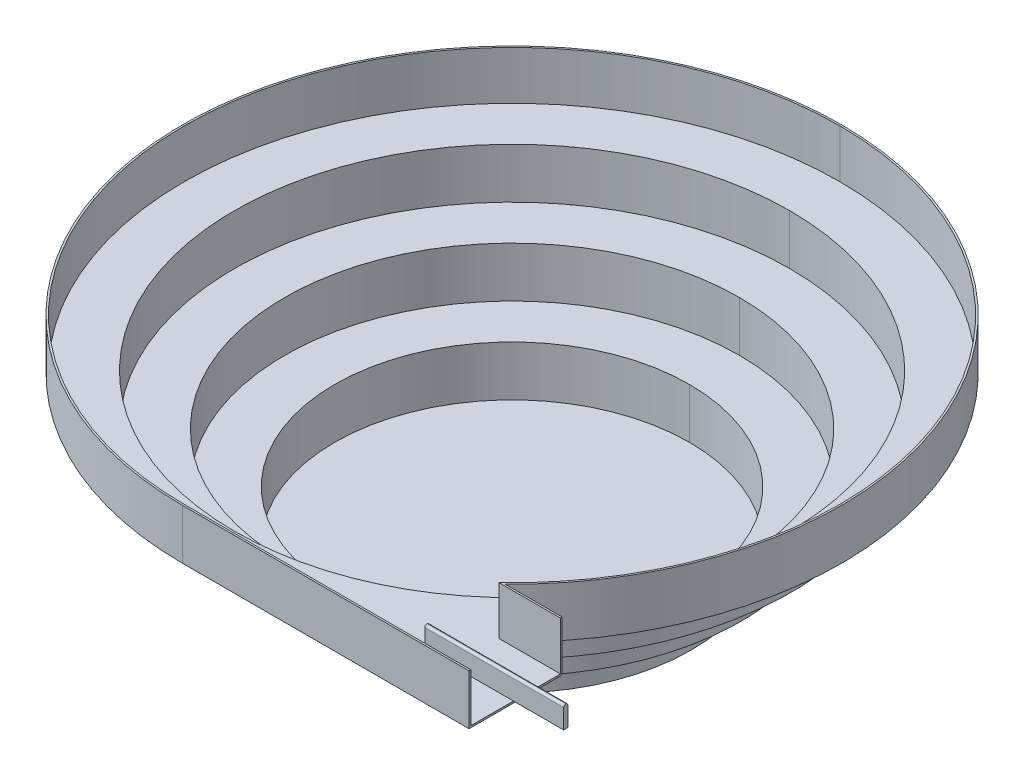
ISO-10303-21;
HEADER;
FILE_DESCRIPTION(('STEP AP214'),'2;1');
FILE_NAME('part.step','',(''),(''),'','','');
FILE_SCHEMA(('AUTOMOTIVE_DESIGN { 1 0 10303 214 1 1 1 1 }'));
ENDSEC;
DATA;
#1=APPLICATION_CONTEXT('core data for automotive mechanical design processes');
#2=APPLICATION_PROTOCOL_DEFINITION('international standard','automotive_design',2000,#1);
#3=PRODUCT_CONTEXT('',#1,'mechanical');
#4=PRODUCT('Part','Part','',(#3));
#5=PRODUCT_RELATED_PRODUCT_CATEGORY('part','',(#4));
#6=PRODUCT_DEFINITION_FORMATION('','',#4);
#7=PRODUCT_DEFINITION_CONTEXT('part definition',#1,'design');
#8=PRODUCT_DEFINITION('design','',#6,#7);
#9=PRODUCT_DEFINITION_SHAPE('','',#8);
#10=(LENGTH_UNIT() NAMED_UNIT(*) SI_UNIT(.MILLI.,.METRE.));
#11=(NAMED_UNIT(*) PLANE_ANGLE_UNIT() SI_UNIT($,.RADIAN.));
#12=(NAMED_UNIT(*) SI_UNIT($,.STERADIAN.) SOLID_ANGLE_UNIT());
#13=UNCERTAINTY_MEASURE_WITH_UNIT(LENGTH_MEASURE(1.E-05),#10,'distance_accuracy_value','');
#14=(GEOMETRIC_REPRESENTATION_CONTEXT(3) GLOBAL_UNCERTAINTY_ASSIGNED_CONTEXT((#13)) GLOBAL_UNIT_ASSIGNED_CONTEXT((#10,
#11,#12)) REPRESENTATION_CONTEXT('',''));
#15=CARTESIAN_POINT('',(0.,0.,0.));
#16=DIRECTION('',(0.,0.,1.));
#17=DIRECTION('',(1.,0.,0.));
#18=AXIS2_PLACEMENT_3D('',#15,#16,#17);
#19=CARTESIAN_POINT('',(0.,210.,0.));
#20=DIRECTION('',(0.,-1.,0.));
#21=DIRECTION('',(0.,0.,-1.));
#22=AXIS2_PLACEMENT_3D('',#19,#20,#21);
#23=CYLINDRICAL_SURFACE('',#22,387.5);
#24=CARTESIAN_POINT('',(0.,212.5,0.));
#25=DIRECTION('',(0.,1.,0.));
#26=DIRECTION('',(0.,0.,1.));
#27=AXIS2_PLACEMENT_3D('',#24,#25,#26);
#28=CIRCLE('',#27,387.5);
#29=CARTESIAN_POINT('',(0.,212.5,-387.5));
#30=VERTEX_POINT('',#29);
#31=CARTESIAN_POINT('',(0.,212.5,387.5));
#32=VERTEX_POINT('',#31);
#33=EDGE_CURVE('E11',#30,#32,#28,.T.);
#34=ORIENTED_EDGE('',*,*,#33,.T.);
#35=DIRECTION('',(0.,-1.,0.));
#36=VECTOR('',#35,1.);
#37=CARTESIAN_POINT('',(0.,210.,387.5));
#38=LINE('',#37,#36);
#39=CARTESIAN_POINT('',(0.,142.5,387.5));
#40=VERTEX_POINT('',#39);
#41=EDGE_CURVE('E27',#32,#40,#38,.T.);
#42=ORIENTED_EDGE('',*,*,#41,.T.);
#43=CARTESIAN_POINT('',(0.,142.5,0.));
#44=DIRECTION('',(0.,1.,0.));
#45=DIRECTION('',(0.,0.,1.));
#46=AXIS2_PLACEMENT_3D('',#43,#44,#45);
#47=CIRCLE('',#46,387.5);
#48=CARTESIAN_POINT('',(0.,142.5,-387.5));
#49=VERTEX_POINT('',#48);
#50=EDGE_CURVE('E335',#49,#40,#47,.T.);
#51=ORIENTED_EDGE('',*,*,#50,.F.);
#52=DIRECTION('',(0.,-1.,0.));
#53=VECTOR('',#52,1.);
#54=CARTESIAN_POINT('',(0.,210.,-387.5));
#55=LINE('',#54,#53);
#56=EDGE_CURVE('E451',#30,#49,#55,.T.);
#57=ORIENTED_EDGE('',*,*,#56,.F.);
#58=EDGE_LOOP('',(#34,#42,#51,#57));
#59=FACE_BOUND('',#58,.T.);
#60=ADVANCED_FACE('F16',(#59),#23,.F.);
#61=CARTESIAN_POINT('',(0.,140.,0.));
#62=DIRECTION('',(0.,-1.,0.));
#63=DIRECTION('',(0.,0.,-1.));
#64=AXIS2_PLACEMENT_3D('',#61,#62,#63);
#65=CYLINDRICAL_SURFACE('',#64,317.5);
#66=CARTESIAN_POINT('',(0.,142.5,0.));
#67=DIRECTION('',(0.,1.,0.));
#68=DIRECTION('',(0.,0.,1.));
#69=AXIS2_PLACEMENT_3D('',#66,#67,#68);
#70=CIRCLE('',#69,317.5);
#71=CARTESIAN_POINT('',(0.,142.5,-317.5));
#72=VERTEX_POINT('',#71);
#73=CARTESIAN_POINT('',(0.,142.5,317.5));
#74=VERTEX_POINT('',#73);
#75=EDGE_CURVE('E321',#72,#74,#70,.T.);
#76=ORIENTED_EDGE('',*,*,#75,.T.);
#77=DIRECTION('',(0.,-1.,0.));
#78=VECTOR('',#77,1.);
#79=CARTESIAN_POINT('',(0.,140.,317.5));
#80=LINE('',#79,#78);
#81=CARTESIAN_POINT('',(0.,72.5,317.5));
#82=VERTEX_POINT('',#81);
#83=EDGE_CURVE('E325',#74,#82,#80,.T.);
#84=ORIENTED_EDGE('',*,*,#83,.T.);
#85=CARTESIAN_POINT('',(0.,72.5,0.));
#86=DIRECTION('',(0.,1.,0.));
#87=DIRECTION('',(0.,0.,1.));
#88=AXIS2_PLACEMENT_3D('',#85,#86,#87);
#89=CIRCLE('',#88,317.5);
#90=CARTESIAN_POINT('',(0.,72.5,-317.5));
#91=VERTEX_POINT('',#90);
#92=EDGE_CURVE('E443',#91,#82,#89,.T.);
#93=ORIENTED_EDGE('',*,*,#92,.F.);
#94=DIRECTION('',(0.,-1.,0.));
#95=VECTOR('',#94,1.);
#96=CARTESIAN_POINT('',(0.,140.,-317.5));
#97=LINE('',#96,#95);
#98=EDGE_CURVE('E350',#72,#91,#97,.T.);
#99=ORIENTED_EDGE('',*,*,#98,.F.);
#100=EDGE_LOOP('',(#76,#84,#93,#99));
#101=FACE_BOUND('',#100,.T.);
#102=ADVANCED_FACE('F957',(#101),#65,.F.);
#103=CARTESIAN_POINT('',(0.,70.,0.));
#104=DIRECTION('',(0.,-1.,0.));
#105=DIRECTION('',(0.,0.,-1.));
#106=AXIS2_PLACEMENT_3D('',#103,#104,#105);
#107=CYLINDRICAL_SURFACE('',#106,247.5);
#108=CARTESIAN_POINT('',(0.,72.5,0.));
#109=DIRECTION('',(0.,1.,0.));
#110=DIRECTION('',(0.,0.,1.));
#111=AXIS2_PLACEMENT_3D('',#108,#109,#110);
#112=CIRCLE('',#111,247.5);
#113=CARTESIAN_POINT('',(0.,72.5,-247.5));
#114=VERTEX_POINT('',#113);
#115=CARTESIAN_POINT('',(0.,72.5,247.5));
#116=VERTEX_POINT('',#115);
#117=EDGE_CURVE('E410',#114,#116,#112,.T.);
#118=ORIENTED_EDGE('',*,*,#117,.T.);
#119=DIRECTION('',(0.,-1.,0.));
#120=VECTOR('',#119,1.);
#121=CARTESIAN_POINT('',(0.,70.,247.5));
#122=LINE('',#121,#120);
#123=CARTESIAN_POINT('',(0.,2.5,247.5));
#124=VERTEX_POINT('',#123);
#125=EDGE_CURVE('E414',#116,#124,#122,.T.);
#126=ORIENTED_EDGE('',*,*,#125,.T.);
#127=CARTESIAN_POINT('',(0.,2.5,0.));
#128=DIRECTION('',(0.,1.,0.));
#129=DIRECTION('',(0.,0.,1.));
#130=AXIS2_PLACEMENT_3D('',#127,#128,#129);
#131=CIRCLE('',#130,247.5);
#132=CARTESIAN_POINT('',(0.,2.5,-247.5));
#133=VERTEX_POINT('',#132);
#134=EDGE_CURVE('E337',#133,#124,#131,.T.);
#135=ORIENTED_EDGE('',*,*,#134,.F.);
#136=DIRECTION('',(0.,-1.,0.));
#137=VECTOR('',#136,1.);
#138=CARTESIAN_POINT('',(0.,70.,-247.5));
#139=LINE('',#138,#137);
#140=EDGE_CURVE('E254',#114,#133,#139,.T.);
#141=ORIENTED_EDGE('',*,*,#140,.F.);
#142=EDGE_LOOP('',(#118,#126,#135,#141));
#143=FACE_BOUND('',#142,.T.);
#144=ADVANCED_FACE('F962',(#143),#107,.F.);
#145=CARTESIAN_POINT('',(0.,280.,0.));
#146=DIRECTION('',(0.,-1.,0.));
#147=DIRECTION('',(0.,0.,-1.));
#148=AXIS2_PLACEMENT_3D('',#145,#146,#147);
#149=CYLINDRICAL_SURFACE('',#148,457.5);
#150=CARTESIAN_POINT('',(0.,280.,0.));
#151=DIRECTION('',(0.,1.,0.));
#152=DIRECTION('',(0.,0.,1.));
#153=AXIS2_PLACEMENT_3D('',#150,#151,#152);
#154=CIRCLE('',#153,457.5);
#155=CARTESIAN_POINT('',(314.245127249413,280.,332.5));
#156=VERTEX_POINT('',#155);
#157=CARTESIAN_POINT('',(0.,280.,-457.5));
#158=VERTEX_POINT('',#157);
#159=EDGE_CURVE('E430',#156,#158,#154,.T.);
#160=ORIENTED_EDGE('',*,*,#159,.T.);
#161=DIRECTION('',(0.,-1.,0.));
#162=VECTOR('',#161,1.);
#163=CARTESIAN_POINT('',(0.,280.,-457.5));
#164=LINE('',#163,#162);
#165=CARTESIAN_POINT('',(0.,212.5,-457.5));
#166=VERTEX_POINT('',#165);
#167=EDGE_CURVE('E225',#158,#166,#164,.T.);
#168=ORIENTED_EDGE('',*,*,#167,.T.);
#169=CARTESIAN_POINT('',(0.,212.5,0.));
#170=DIRECTION('',(0.,1.,0.));
#171=DIRECTION('',(0.,0.,1.));
#172=AXIS2_PLACEMENT_3D('',#169,#170,#171);
#173=CIRCLE('',#172,457.5);
#174=CARTESIAN_POINT('',(314.245127249413,212.5,332.5));
#175=VERTEX_POINT('',#174);
#176=EDGE_CURVE('E326',#175,#166,#173,.T.);
#177=ORIENTED_EDGE('',*,*,#176,.F.);
#178=DIRECTION('',(0.,1.,0.));
#179=VECTOR('',#178,1.);
#180=CARTESIAN_POINT('',(314.245127249413,212.5,332.5));
#181=LINE('',#180,#179);
#182=EDGE_CURVE('E282',#175,#156,#181,.T.);
#183=ORIENTED_EDGE('',*,*,#182,.T.);
#184=EDGE_LOOP('',(#160,#168,#177,#183));
#185=FACE_BOUND('',#184,.T.);
#186=ADVANCED_FACE('F1007',(#185),#149,.F.);
#187=CARTESIAN_POINT('',(0.,210.,0.));
#188=DIRECTION('',(0.,-1.,0.));
#189=DIRECTION('',(0.,0.,-1.));
#190=AXIS2_PLACEMENT_3D('',#187,#188,#189);
#191=CYLINDRICAL_SURFACE('',#190,390.);
#192=CARTESIAN_POINT('',(0.,210.,0.));
#193=DIRECTION('',(0.,1.,0.));
#194=DIRECTION('',(0.,0.,1.));
#195=AXIS2_PLACEMENT_3D('',#192,#193,#194);
#196=CIRCLE('',#195,390.);
#197=CARTESIAN_POINT('',(0.,210.,390.));
#198=VERTEX_POINT('',#197);
#199=CARTESIAN_POINT('',(0.,210.,-390.));
#200=VERTEX_POINT('',#199);
#201=EDGE_CURVE('E422',#198,#200,#196,.T.);
#202=ORIENTED_EDGE('',*,*,#201,.F.);
#203=DIRECTION('',(0.,-1.,0.));
#204=VECTOR('',#203,1.);
#205=CARTESIAN_POINT('',(0.,210.,390.));
#206=LINE('',#205,#204);
#207=CARTESIAN_POINT('',(0.,140.,390.));
#208=VERTEX_POINT('',#207);
#209=EDGE_CURVE('E278',#198,#208,#206,.T.);
#210=ORIENTED_EDGE('',*,*,#209,.T.);
#211=CARTESIAN_POINT('',(0.,140.,0.));
#212=DIRECTION('',(0.,1.,0.));
#213=DIRECTION('',(0.,0.,1.));
#214=AXIS2_PLACEMENT_3D('',#211,#212,#213);
#215=CIRCLE('',#214,390.);
#216=CARTESIAN_POINT('',(0.,140.,-390.));
#217=VERTEX_POINT('',#216);
#218=EDGE_CURVE('E283',#208,#217,#215,.T.);
#219=ORIENTED_EDGE('',*,*,#218,.T.);
#220=DIRECTION('',(0.,-1.,0.));
#221=VECTOR('',#220,1.);
#222=CARTESIAN_POINT('',(0.,210.,-390.));
#223=LINE('',#222,#221);
#224=EDGE_CURVE('E311',#200,#217,#223,.T.);
#225=ORIENTED_EDGE('',*,*,#224,.F.);
#226=EDGE_LOOP('',(#202,#210,#219,#225));
#227=FACE_BOUND('',#226,.T.);
#228=ADVANCED_FACE('F1002',(#227),#191,.T.);
#229=CARTESIAN_POINT('',(0.,140.,0.));
#230=DIRECTION('',(0.,-1.,0.));
#231=DIRECTION('',(0.,0.,-1.));
#232=AXIS2_PLACEMENT_3D('',#229,#230,#231);
#233=CYLINDRICAL_SURFACE('',#232,320.);
#234=CARTESIAN_POINT('',(0.,140.,0.));
#235=DIRECTION('',(0.,1.,0.));
#236=DIRECTION('',(0.,0.,1.));
#237=AXIS2_PLACEMENT_3D('',#234,#235,#236);
#238=CIRCLE('',#237,320.);
#239=CARTESIAN_POINT('',(0.,140.,320.));
#240=VERTEX_POINT('',#239);
#241=CARTESIAN_POINT('',(0.,140.,-320.));
#242=VERTEX_POINT('',#241);
#243=EDGE_CURVE('E258',#240,#242,#238,.T.);
#244=ORIENTED_EDGE('',*,*,#243,.F.);
#245=DIRECTION('',(0.,-1.,0.));
#246=VECTOR('',#245,1.);
#247=CARTESIAN_POINT('',(0.,140.,320.));
#248=LINE('',#247,#246);
#249=CARTESIAN_POINT('',(0.,70.,320.));
#250=VERTEX_POINT('',#249);
#251=EDGE_CURVE('E287',#240,#250,#248,.T.);
#252=ORIENTED_EDGE('',*,*,#251,.T.);
#253=CARTESIAN_POINT('',(0.,70.,0.));
#254=DIRECTION('',(0.,1.,0.));
#255=DIRECTION('',(0.,0.,1.));
#256=AXIS2_PLACEMENT_3D('',#253,#254,#255);
#257=CIRCLE('',#256,320.);
#258=CARTESIAN_POINT('',(0.,70.,-320.));
#259=VERTEX_POINT('',#258);
#260=EDGE_CURVE('E361',#250,#259,#257,.T.);
#261=ORIENTED_EDGE('',*,*,#260,.T.);
#262=DIRECTION('',(0.,-1.,0.));
#263=VECTOR('',#262,1.);
#264=CARTESIAN_POINT('',(0.,140.,-320.));
#265=LINE('',#264,#263);
#266=EDGE_CURVE('E429',#242,#259,#265,.T.);
#267=ORIENTED_EDGE('',*,*,#266,.F.);
#268=EDGE_LOOP('',(#244,#252,#261,#267));
#269=FACE_BOUND('',#268,.T.);
#270=ADVANCED_FACE('F577',(#269),#233,.T.);
#271=CARTESIAN_POINT('',(0.,70.,0.));
#272=DIRECTION('',(0.,-1.,0.));
#273=DIRECTION('',(0.,0.,-1.));
#274=AXIS2_PLACEMENT_3D('',#271,#272,#273);
#275=CYLINDRICAL_SURFACE('',#274,250.);
#276=CARTESIAN_POINT('',(0.,70.,0.));
#277=DIRECTION('',(0.,1.,0.));
#278=DIRECTION('',(0.,0.,1.));
#279=AXIS2_PLACEMENT_3D('',#276,#277,#278);
#280=CIRCLE('',#279,250.);
#281=CARTESIAN_POINT('',(0.,70.,250.));
#282=VERTEX_POINT('',#281);
#283=CARTESIAN_POINT('',(0.,70.,-250.));
#284=VERTEX_POINT('',#283);
#285=EDGE_CURVE('E381',#282,#284,#280,.T.);
#286=ORIENTED_EDGE('',*,*,#285,.F.);
#287=DIRECTION('',(0.,-1.,0.));
#288=VECTOR('',#287,1.);
#289=CARTESIAN_POINT('',(0.,70.,250.));
#290=LINE('',#289,#288);
#291=CARTESIAN_POINT('',(0.,0.,250.));
#292=VERTEX_POINT('',#291);
#293=EDGE_CURVE('E375',#282,#292,#290,.T.);
#294=ORIENTED_EDGE('',*,*,#293,.T.);
#295=CARTESIAN_POINT('',(0.,0.,0.));
#296=DIRECTION('',(0.,1.,0.));
#297=DIRECTION('',(0.,0.,1.));
#298=AXIS2_PLACEMENT_3D('',#295,#296,#297);
#299=CIRCLE('',#298,250.);
#300=CARTESIAN_POINT('',(0.,0.,-250.));
#301=VERTEX_POINT('',#300);
#302=EDGE_CURVE('E387',#292,#301,#299,.T.);
#303=ORIENTED_EDGE('',*,*,#302,.T.);
#304=DIRECTION('',(0.,-1.,0.));
#305=VECTOR('',#304,1.);
#306=CARTESIAN_POINT('',(0.,70.,-250.));
#307=LINE('',#306,#305);
#308=EDGE_CURVE('E293',#284,#301,#307,.T.);
#309=ORIENTED_EDGE('',*,*,#308,.F.);
#310=EDGE_LOOP('',(#286,#294,#303,#309));
#311=FACE_BOUND('',#310,.T.);
#312=ADVANCED_FACE('F1174',(#311),#275,.T.);
#313=CARTESIAN_POINT('',(0.,280.,0.));
#314=DIRECTION('',(0.,-1.,0.));
#315=DIRECTION('',(0.,0.,-1.));
#316=AXIS2_PLACEMENT_3D('',#313,#314,#315);
#317=CYLINDRICAL_SURFACE('',#316,460.);
#318=CARTESIAN_POINT('',(0.,280.,0.));
#319=DIRECTION('',(0.,1.,0.));
#320=DIRECTION('',(0.,0.,1.));
#321=AXIS2_PLACEMENT_3D('',#318,#319,#320);
#322=CIRCLE('',#321,460.);
#323=CARTESIAN_POINT('',(0.,280.,-460.));
#324=VERTEX_POINT('',#323);
#325=CARTESIAN_POINT('',(0.,280.,460.));
#326=VERTEX_POINT('',#325);
#327=EDGE_CURVE('E436',#324,#326,#322,.T.);
#328=ORIENTED_EDGE('',*,*,#327,.F.);
#329=DIRECTION('',(0.,-1.,0.));
#330=VECTOR('',#329,1.);
#331=CARTESIAN_POINT('',(0.,280.,-460.));
#332=LINE('',#331,#330);
#333=CARTESIAN_POINT('',(0.,210.,-460.));
#334=VERTEX_POINT('',#333);
#335=EDGE_CURVE('E320',#324,#334,#332,.T.);
#336=ORIENTED_EDGE('',*,*,#335,.T.);
#337=CARTESIAN_POINT('',(0.,210.,0.));
#338=DIRECTION('',(0.,1.,0.));
#339=DIRECTION('',(0.,0.,1.));
#340=AXIS2_PLACEMENT_3D('',#337,#338,#339);
#341=CIRCLE('',#340,460.);
#342=CARTESIAN_POINT('',(0.,210.,460.));
#343=VERTEX_POINT('',#342);
#344=EDGE_CURVE('E240',#334,#343,#341,.T.);
#345=ORIENTED_EDGE('',*,*,#344,.T.);
#346=DIRECTION('',(0.,-1.,0.));
#347=VECTOR('',#346,1.);
#348=CARTESIAN_POINT('',(0.,280.,460.));
#349=LINE('',#348,#347);
#350=EDGE_CURVE('E288',#326,#343,#349,.T.);
#351=ORIENTED_EDGE('',*,*,#350,.F.);
#352=EDGE_LOOP('',(#328,#336,#345,#351));
#353=FACE_BOUND('',#352,.T.);
#354=ADVANCED_FACE('F636',(#353),#317,.T.);
#355=CARTESIAN_POINT('',(0.,280.,0.));
#356=DIRECTION('',(0.,1.,0.));
#357=DIRECTION('',(1.,0.,0.));
#358=AXIS2_PLACEMENT_3D('',#355,#356,#357);
#359=PLANE('',#358);
#360=DIRECTION('',(0.,0.,1.));
#361=VECTOR('',#360,1.);
#362=CARTESIAN_POINT('',(400.,280.,460.));
#363=LINE('',#362,#361);
#364=CARTESIAN_POINT('',(400.,280.,457.5));
#365=VERTEX_POINT('',#364);
#366=CARTESIAN_POINT('',(400.,280.,460.));
#367=VERTEX_POINT('',#366);
#368=EDGE_CURVE('E236',#365,#367,#363,.T.);
#369=ORIENTED_EDGE('',*,*,#368,.F.);
#370=DIRECTION('',(-1.,0.,0.));
#371=VECTOR('',#370,1.);
#372=CARTESIAN_POINT('',(0.,280.,457.5));
#373=LINE('',#372,#371);
#374=CARTESIAN_POINT('',(0.,280.,457.5));
#375=VERTEX_POINT('',#374);
#376=EDGE_CURVE('E233',#365,#375,#373,.T.);
#377=ORIENTED_EDGE('',*,*,#376,.T.);
#378=CARTESIAN_POINT('',(0.,280.,0.));
#379=DIRECTION('',(0.,1.,0.));
#380=DIRECTION('',(0.,0.,1.));
#381=AXIS2_PLACEMENT_3D('',#378,#379,#380);
#382=CIRCLE('',#381,457.5);
#383=EDGE_CURVE('E217',#158,#375,#382,.T.);
#384=ORIENTED_EDGE('',*,*,#383,.F.);
#385=ORIENTED_EDGE('',*,*,#159,.F.);
#386=DIRECTION('',(-1.,0.,0.));
#387=VECTOR('',#386,1.);
#388=CARTESIAN_POINT('',(400.,280.,332.5));
#389=LINE('',#388,#387);
#390=CARTESIAN_POINT('',(400.,280.,332.5));
#391=VERTEX_POINT('',#390);
#392=EDGE_CURVE('E396',#391,#156,#389,.T.);
#393=ORIENTED_EDGE('',*,*,#392,.F.);
#394=DIRECTION('',(0.,0.,1.));
#395=VECTOR('',#394,1.);
#396=CARTESIAN_POINT('',(400.,280.,460.));
#397=LINE('',#396,#395);
#398=CARTESIAN_POINT('',(400.,280.,330.));
#399=VERTEX_POINT('',#398);
#400=EDGE_CURVE('E230',#399,#391,#397,.T.);
#401=ORIENTED_EDGE('',*,*,#400,.F.);
#402=DIRECTION('',(-1.,0.,0.));
#403=VECTOR('',#402,1.);
#404=CARTESIAN_POINT('',(400.,280.,330.));
#405=LINE('',#404,#403);
#406=CARTESIAN_POINT('',(320.468407179242,280.,330.));
#407=VERTEX_POINT('',#406);
#408=EDGE_CURVE('E241',#399,#407,#405,.T.);
#409=ORIENTED_EDGE('',*,*,#408,.T.);
#410=CARTESIAN_POINT('',(0.,280.,0.));
#411=DIRECTION('',(0.,1.,0.));
#412=DIRECTION('',(0.,0.,1.));
#413=AXIS2_PLACEMENT_3D('',#410,#411,#412);
#414=CIRCLE('',#413,460.);
#415=EDGE_CURVE('E406',#407,#324,#414,.T.);
#416=ORIENTED_EDGE('',*,*,#415,.T.);
#417=ORIENTED_EDGE('',*,*,#327,.T.);
#418=DIRECTION('',(-1.,0.,0.));
#419=VECTOR('',#418,1.);
#420=CARTESIAN_POINT('',(400.,280.,460.));
#421=LINE('',#420,#419);
#422=EDGE_CURVE('E292',#367,#326,#421,.T.);
#423=ORIENTED_EDGE('',*,*,#422,.F.);
#424=EDGE_LOOP('',(#369,#377,#384,#385,#393,#401,#409,#416,#417,#423));
#425=FACE_BOUND('',#424,.T.);
#426=ADVANCED_FACE('F234',(#425),#359,.T.);
#427=CARTESIAN_POINT('',(0.,280.,0.));
#428=DIRECTION('',(0.,-1.,0.));
#429=DIRECTION('',(0.,0.,-1.));
#430=AXIS2_PLACEMENT_3D('',#427,#428,#429);
#431=CYLINDRICAL_SURFACE('',#430,460.);
#432=ORIENTED_EDGE('',*,*,#335,.F.);
#433=ORIENTED_EDGE('',*,*,#415,.F.);
#434=DIRECTION('',(0.,1.,0.));
#435=VECTOR('',#434,1.);
#436=CARTESIAN_POINT('',(320.468407179242,280.,330.));
#437=LINE('',#436,#435);
#438=CARTESIAN_POINT('',(320.468407179242,210.,330.));
#439=VERTEX_POINT('',#438);
#440=EDGE_CURVE('E291',#439,#407,#437,.T.);
#441=ORIENTED_EDGE('',*,*,#440,.F.);
#442=CARTESIAN_POINT('',(0.,210.,0.));
#443=DIRECTION('',(0.,1.,0.));
#444=DIRECTION('',(0.,0.,1.));
#445=AXIS2_PLACEMENT_3D('',#442,#443,#444);
#446=CIRCLE('',#445,460.);
#447=EDGE_CURVE('E296',#439,#334,#446,.T.);
#448=ORIENTED_EDGE('',*,*,#447,.T.);
#449=EDGE_LOOP('',(#432,#433,#441,#448));
#450=FACE_BOUND('',#449,.T.);
#451=ADVANCED_FACE('F638',(#450),#431,.T.);
#452=CARTESIAN_POINT('',(0.,70.,0.));
#453=DIRECTION('',(0.,-1.,0.));
#454=DIRECTION('',(0.,0.,-1.));
#455=AXIS2_PLACEMENT_3D('',#452,#453,#454);
#456=CYLINDRICAL_SURFACE('',#455,250.);
#457=ORIENTED_EDGE('',*,*,#293,.F.);
#458=CARTESIAN_POINT('',(0.,70.,0.));
#459=DIRECTION('',(0.,1.,0.));
#460=DIRECTION('',(0.,0.,1.));
#461=AXIS2_PLACEMENT_3D('',#458,#459,#460);
#462=CIRCLE('',#461,250.);
#463=EDGE_CURVE('E376',#284,#282,#462,.T.);
#464=ORIENTED_EDGE('',*,*,#463,.F.);
#465=ORIENTED_EDGE('',*,*,#308,.T.);
#466=CARTESIAN_POINT('',(0.,0.,0.));
#467=DIRECTION('',(0.,1.,0.));
#468=DIRECTION('',(0.,0.,1.));
#469=AXIS2_PLACEMENT_3D('',#466,#467,#468);
#470=CIRCLE('',#469,250.);
#471=EDGE_CURVE('E20',#301,#292,#470,.T.);
#472=ORIENTED_EDGE('',*,*,#471,.T.);
#473=EDGE_LOOP('',(#457,#464,#465,#472));
#474=FACE_BOUND('',#473,.T.);
#475=ADVANCED_FACE('F591',(#474),#456,.T.);
#476=CARTESIAN_POINT('',(0.,0.,0.));
#477=DIRECTION('',(0.,1.,0.));
#478=DIRECTION('',(1.,0.,0.));
#479=AXIS2_PLACEMENT_3D('',#476,#477,#478);
#480=PLANE('',#479);
#481=ORIENTED_EDGE('',*,*,#471,.F.);
#482=ORIENTED_EDGE('',*,*,#302,.F.);
#483=EDGE_LOOP('',(#481,#482));
#484=FACE_BOUND('',#483,.T.);
#485=ADVANCED_FACE('F1115',(#484),#480,.F.);
#486=CARTESIAN_POINT('',(0.,140.,0.));
#487=DIRECTION('',(0.,-1.,0.));
#488=DIRECTION('',(0.,0.,-1.));
#489=AXIS2_PLACEMENT_3D('',#486,#487,#488);
#490=CYLINDRICAL_SURFACE('',#489,320.);
#491=ORIENTED_EDGE('',*,*,#251,.F.);
#492=CARTESIAN_POINT('',(0.,140.,0.));
#493=DIRECTION('',(0.,1.,0.));
#494=DIRECTION('',(0.,0.,1.));
#495=AXIS2_PLACEMENT_3D('',#492,#493,#494);
#496=CIRCLE('',#495,320.);
#497=EDGE_CURVE('E312',#242,#240,#496,.T.);
#498=ORIENTED_EDGE('',*,*,#497,.F.);
#499=ORIENTED_EDGE('',*,*,#266,.T.);
#500=CARTESIAN_POINT('',(0.,70.,0.));
#501=DIRECTION('',(0.,1.,0.));
#502=DIRECTION('',(0.,0.,1.));
#503=AXIS2_PLACEMENT_3D('',#500,#501,#502);
#504=CIRCLE('',#503,320.);
#505=EDGE_CURVE('E380',#259,#250,#504,.T.);
#506=ORIENTED_EDGE('',*,*,#505,.T.);
#507=EDGE_LOOP('',(#491,#498,#499,#506));
#508=FACE_BOUND('',#507,.T.);
#509=ADVANCED_FACE('F580',(#508),#490,.T.);
#510=CARTESIAN_POINT('',(0.,70.,0.));
#511=DIRECTION('',(0.,1.,0.));
#512=DIRECTION('',(1.,0.,0.));
#513=AXIS2_PLACEMENT_3D('',#510,#511,#512);
#514=PLANE('',#513);
#515=ORIENTED_EDGE('',*,*,#505,.F.);
#516=ORIENTED_EDGE('',*,*,#260,.F.);
#517=EDGE_LOOP('',(#515,#516));
#518=FACE_BOUND('',#517,.T.);
#519=ORIENTED_EDGE('',*,*,#463,.T.);
#520=ORIENTED_EDGE('',*,*,#285,.T.);
#521=EDGE_LOOP('',(#519,#520));
#522=FACE_BOUND('',#521,.T.);
#523=ADVANCED_FACE('F582',(#518,#522),#514,.F.);
#524=CARTESIAN_POINT('',(0.,210.,0.));
#525=DIRECTION('',(0.,-1.,0.));
#526=DIRECTION('',(0.,0.,-1.));
#527=AXIS2_PLACEMENT_3D('',#524,#525,#526);
#528=CYLINDRICAL_SURFACE('',#527,390.);
#529=ORIENTED_EDGE('',*,*,#209,.F.);
#530=CARTESIAN_POINT('',(0.,210.,0.));
#531=DIRECTION('',(0.,1.,0.));
#532=DIRECTION('',(0.,0.,1.));
#533=AXIS2_PLACEMENT_3D('',#530,#531,#532);
#534=CIRCLE('',#533,390.);
#535=EDGE_CURVE('E425',#200,#198,#534,.T.);
#536=ORIENTED_EDGE('',*,*,#535,.F.);
#537=ORIENTED_EDGE('',*,*,#224,.T.);
#538=CARTESIAN_POINT('',(0.,140.,0.));
#539=DIRECTION('',(0.,1.,0.));
#540=DIRECTION('',(0.,0.,1.));
#541=AXIS2_PLACEMENT_3D('',#538,#539,#540);
#542=CIRCLE('',#541,390.);
#543=EDGE_CURVE('E307',#217,#208,#542,.T.);
#544=ORIENTED_EDGE('',*,*,#543,.T.);
#545=EDGE_LOOP('',(#529,#536,#537,#544));
#546=FACE_BOUND('',#545,.T.);
#547=ADVANCED_FACE('F585',(#546),#528,.T.);
#548=CARTESIAN_POINT('',(0.,140.,0.));
#549=DIRECTION('',(0.,1.,0.));
#550=DIRECTION('',(1.,0.,0.));
#551=AXIS2_PLACEMENT_3D('',#548,#549,#550);
#552=PLANE('',#551);
#553=ORIENTED_EDGE('',*,*,#543,.F.);
#554=ORIENTED_EDGE('',*,*,#218,.F.);
#555=EDGE_LOOP('',(#553,#554));
#556=FACE_BOUND('',#555,.T.);
#557=ORIENTED_EDGE('',*,*,#497,.T.);
#558=ORIENTED_EDGE('',*,*,#243,.T.);
#559=EDGE_LOOP('',(#557,#558));
#560=FACE_BOUND('',#559,.T.);
#561=ADVANCED_FACE('F571',(#556,#560),#552,.F.);
#562=CARTESIAN_POINT('',(0.,210.,0.));
#563=DIRECTION('',(0.,1.,0.));
#564=DIRECTION('',(1.,0.,0.));
#565=AXIS2_PLACEMENT_3D('',#562,#563,#564);
#566=PLANE('',#565);
#567=ORIENTED_EDGE('',*,*,#447,.F.);
#568=DIRECTION('',(-1.,0.,0.));
#569=VECTOR('',#568,1.);
#570=CARTESIAN_POINT('',(400.,210.,330.));
#571=LINE('',#570,#569);
#572=CARTESIAN_POINT('',(400.,210.,330.));
#573=VERTEX_POINT('',#572);
#574=EDGE_CURVE('E421',#573,#439,#571,.T.);
#575=ORIENTED_EDGE('',*,*,#574,.F.);
#576=DIRECTION('',(0.,0.,-1.));
#577=VECTOR('',#576,1.);
#578=CARTESIAN_POINT('',(400.,210.,460.));
#579=LINE('',#578,#577);
#580=CARTESIAN_POINT('',(400.,210.,460.));
#581=VERTEX_POINT('',#580);
#582=EDGE_CURVE('E341',#581,#573,#579,.T.);
#583=ORIENTED_EDGE('',*,*,#582,.F.);
#584=DIRECTION('',(-1.,0.,0.));
#585=VECTOR('',#584,1.);
#586=CARTESIAN_POINT('',(400.,210.,460.));
#587=LINE('',#586,#585);
#588=EDGE_CURVE('E536',#581,#343,#587,.T.);
#589=ORIENTED_EDGE('',*,*,#588,.T.);
#590=ORIENTED_EDGE('',*,*,#344,.F.);
#591=EDGE_LOOP('',(#567,#575,#583,#589,#590));
#592=FACE_BOUND('',#591,.T.);
#593=ORIENTED_EDGE('',*,*,#535,.T.);
#594=ORIENTED_EDGE('',*,*,#201,.T.);
#595=EDGE_LOOP('',(#593,#594));
#596=FACE_BOUND('',#595,.T.);
#597=ADVANCED_FACE('F631',(#592,#596),#566,.F.);
#598=CARTESIAN_POINT('',(400.,280.,330.));
#599=DIRECTION('',(0.,0.,1.));
#600=DIRECTION('',(1.,0.,0.));
#601=AXIS2_PLACEMENT_3D('',#598,#599,#600);
#602=PLANE('',#601);
#603=ORIENTED_EDGE('',*,*,#574,.T.);
#604=ORIENTED_EDGE('',*,*,#440,.T.);
#605=ORIENTED_EDGE('',*,*,#408,.F.);
#606=DIRECTION('',(0.,1.,0.));
#607=VECTOR('',#606,1.);
#608=CARTESIAN_POINT('',(400.,280.,330.));
#609=LINE('',#608,#607);
#610=EDGE_CURVE('E345',#573,#399,#609,.T.);
#611=ORIENTED_EDGE('',*,*,#610,.F.);
#612=EDGE_LOOP('',(#603,#604,#605,#611));
#613=FACE_BOUND('',#612,.T.);
#614=ADVANCED_FACE('F641',(#613),#602,.F.);
#615=CARTESIAN_POINT('',(400.,280.,460.));
#616=DIRECTION('',(0.,0.,-1.));
#617=DIRECTION('',(0.,-1.,0.));
#618=AXIS2_PLACEMENT_3D('',#615,#616,#617);
#619=PLANE('',#618);
#620=ORIENTED_EDGE('',*,*,#350,.T.);
#621=ORIENTED_EDGE('',*,*,#588,.F.);
#622=DIRECTION('',(0.,-1.,0.));
#623=VECTOR('',#622,1.);
#624=CARTESIAN_POINT('',(400.,280.,460.));
#625=LINE('',#624,#623);
#626=EDGE_CURVE('E344',#367,#581,#625,.T.);
#627=ORIENTED_EDGE('',*,*,#626,.F.);
#628=ORIENTED_EDGE('',*,*,#422,.T.);
#629=EDGE_LOOP('',(#620,#621,#627,#628));
#630=FACE_BOUND('',#629,.T.);
#631=ADVANCED_FACE('F646',(#630),#619,.F.);
#632=CARTESIAN_POINT('',(400.,0.,0.));
#633=DIRECTION('',(1.,0.,0.));
#634=DIRECTION('',(0.,1.,0.));
#635=AXIS2_PLACEMENT_3D('',#632,#633,#634);
#636=PLANE('',#635);
#637=DIRECTION('',(0.,-1.,0.));
#638=VECTOR('',#637,1.);
#639=CARTESIAN_POINT('',(400.,280.,457.5));
#640=LINE('',#639,#638);
#641=CARTESIAN_POINT('',(400.,212.5,457.5));
#642=VERTEX_POINT('',#641);
#643=EDGE_CURVE('E390',#365,#642,#640,.T.);
#644=ORIENTED_EDGE('',*,*,#643,.F.);
#645=ORIENTED_EDGE('',*,*,#368,.T.);
#646=ORIENTED_EDGE('',*,*,#626,.T.);
#647=ORIENTED_EDGE('',*,*,#582,.T.);
#648=ORIENTED_EDGE('',*,*,#610,.T.);
#649=ORIENTED_EDGE('',*,*,#400,.T.);
#650=DIRECTION('',(0.,1.,0.));
#651=VECTOR('',#650,1.);
#652=CARTESIAN_POINT('',(400.,280.,332.5));
#653=LINE('',#652,#651);
#654=CARTESIAN_POINT('',(400.,212.5,332.5));
#655=VERTEX_POINT('',#654);
#656=EDGE_CURVE('E391',#655,#391,#653,.T.);
#657=ORIENTED_EDGE('',*,*,#656,.F.);
#658=DIRECTION('',(0.,0.,-1.));
#659=VECTOR('',#658,1.);
#660=CARTESIAN_POINT('',(400.,212.5,0.));
#661=LINE('',#660,#659);
#662=CARTESIAN_POINT('',(400.,212.5,392.));
#663=VERTEX_POINT('',#662);
#664=EDGE_CURVE('E354',#663,#655,#661,.T.);
#665=ORIENTED_EDGE('',*,*,#664,.F.);
#666=DIRECTION('',(0.,0.,-1.));
#667=VECTOR('',#666,1.);
#668=CARTESIAN_POINT('',(400.,212.5,0.));
#669=LINE('',#668,#667);
#670=CARTESIAN_POINT('',(400.,212.5,398.));
#671=VERTEX_POINT('',#670);
#672=EDGE_CURVE('E313',#671,#663,#669,.T.);
#673=ORIENTED_EDGE('',*,*,#672,.F.);
#674=DIRECTION('',(0.,0.,-1.));
#675=VECTOR('',#674,1.);
#676=CARTESIAN_POINT('',(400.,212.5,0.));
#677=LINE('',#676,#675);
#678=EDGE_CURVE('E402',#642,#671,#677,.T.);
#679=ORIENTED_EDGE('',*,*,#678,.F.);
#680=EDGE_LOOP('',(#644,#645,#646,#647,#648,#649,#657,#665,#673,#679));
#681=FACE_BOUND('',#680,.T.);
#682=ADVANCED_FACE('F647',(#681),#636,.T.);
#683=CARTESIAN_POINT('',(0.,280.,0.));
#684=DIRECTION('',(0.,-1.,0.));
#685=DIRECTION('',(0.,0.,-1.));
#686=AXIS2_PLACEMENT_3D('',#683,#684,#685);
#687=CYLINDRICAL_SURFACE('',#686,457.5);
#688=ORIENTED_EDGE('',*,*,#167,.F.);
#689=ORIENTED_EDGE('',*,*,#383,.T.);
#690=DIRECTION('',(0.,-1.,0.));
#691=VECTOR('',#690,1.);
#692=CARTESIAN_POINT('',(0.,280.,457.5));
#693=LINE('',#692,#691);
#694=CARTESIAN_POINT('',(0.,212.5,457.5));
#695=VERTEX_POINT('',#694);
#696=EDGE_CURVE('E222',#375,#695,#693,.T.);
#697=ORIENTED_EDGE('',*,*,#696,.T.);
#698=CARTESIAN_POINT('',(0.,212.5,0.));
#699=DIRECTION('',(0.,1.,0.));
#700=DIRECTION('',(0.,0.,1.));
#701=AXIS2_PLACEMENT_3D('',#698,#699,#700);
#702=CIRCLE('',#701,457.5);
#703=EDGE_CURVE('E330',#166,#695,#702,.T.);
#704=ORIENTED_EDGE('',*,*,#703,.F.);
#705=EDGE_LOOP('',(#688,#689,#697,#704));
#706=FACE_BOUND('',#705,.T.);
#707=ADVANCED_FACE('F219',(#706),#687,.F.);
#708=CARTESIAN_POINT('',(0.,70.,0.));
#709=DIRECTION('',(0.,-1.,0.));
#710=DIRECTION('',(0.,0.,-1.));
#711=AXIS2_PLACEMENT_3D('',#708,#709,#710);
#712=CYLINDRICAL_SURFACE('',#711,247.5);
#713=ORIENTED_EDGE('',*,*,#125,.F.);
#714=CARTESIAN_POINT('',(0.,72.5,0.));
#715=DIRECTION('',(0.,1.,0.));
#716=DIRECTION('',(0.,0.,1.));
#717=AXIS2_PLACEMENT_3D('',#714,#715,#716);
#718=CIRCLE('',#717,247.5);
#719=EDGE_CURVE('E247',#116,#114,#718,.T.);
#720=ORIENTED_EDGE('',*,*,#719,.T.);
#721=ORIENTED_EDGE('',*,*,#140,.T.);
#722=CARTESIAN_POINT('',(0.,2.5,0.));
#723=DIRECTION('',(0.,1.,0.));
#724=DIRECTION('',(0.,0.,1.));
#725=AXIS2_PLACEMENT_3D('',#722,#723,#724);
#726=CIRCLE('',#725,247.5);
#727=EDGE_CURVE('E340',#124,#133,#726,.T.);
#728=ORIENTED_EDGE('',*,*,#727,.F.);
#729=EDGE_LOOP('',(#713,#720,#721,#728));
#730=FACE_BOUND('',#729,.T.);
#731=ADVANCED_FACE('F1037',(#730),#712,.F.);
#732=CARTESIAN_POINT('',(0.,2.5,0.));
#733=DIRECTION('',(0.,1.,0.));
#734=DIRECTION('',(1.,0.,0.));
#735=AXIS2_PLACEMENT_3D('',#732,#733,#734);
#736=PLANE('',#735);
#737=ORIENTED_EDGE('',*,*,#134,.T.);
#738=ORIENTED_EDGE('',*,*,#727,.T.);
#739=EDGE_LOOP('',(#737,#738));
#740=FACE_BOUND('',#739,.T.);
#741=ADVANCED_FACE('F1042',(#740),#736,.T.);
#742=CARTESIAN_POINT('',(0.,140.,0.));
#743=DIRECTION('',(0.,-1.,0.));
#744=DIRECTION('',(0.,0.,-1.));
#745=AXIS2_PLACEMENT_3D('',#742,#743,#744);
#746=CYLINDRICAL_SURFACE('',#745,317.5);
#747=ORIENTED_EDGE('',*,*,#83,.F.);
#748=CARTESIAN_POINT('',(0.,142.5,0.));
#749=DIRECTION('',(0.,1.,0.));
#750=DIRECTION('',(0.,0.,1.));
#751=AXIS2_PLACEMENT_3D('',#748,#749,#750);
#752=CIRCLE('',#751,317.5);
#753=EDGE_CURVE('E346',#74,#72,#752,.T.);
#754=ORIENTED_EDGE('',*,*,#753,.T.);
#755=ORIENTED_EDGE('',*,*,#98,.T.);
#756=CARTESIAN_POINT('',(0.,72.5,0.));
#757=DIRECTION('',(0.,1.,0.));
#758=DIRECTION('',(0.,0.,1.));
#759=AXIS2_PLACEMENT_3D('',#756,#757,#758);
#760=CIRCLE('',#759,317.5);
#761=EDGE_CURVE('E439',#82,#91,#760,.T.);
#762=ORIENTED_EDGE('',*,*,#761,.F.);
#763=EDGE_LOOP('',(#747,#754,#755,#762));
#764=FACE_BOUND('',#763,.T.);
#765=ADVANCED_FACE('F1129',(#764),#746,.F.);
#766=CARTESIAN_POINT('',(0.,72.5,0.));
#767=DIRECTION('',(0.,1.,0.));
#768=DIRECTION('',(1.,0.,0.));
#769=AXIS2_PLACEMENT_3D('',#766,#767,#768);
#770=PLANE('',#769);
#771=ORIENTED_EDGE('',*,*,#92,.T.);
#772=ORIENTED_EDGE('',*,*,#761,.T.);
#773=EDGE_LOOP('',(#771,#772));
#774=FACE_BOUND('',#773,.T.);
#775=ORIENTED_EDGE('',*,*,#117,.F.);
#776=ORIENTED_EDGE('',*,*,#719,.F.);
#777=EDGE_LOOP('',(#775,#776));
#778=FACE_BOUND('',#777,.T.);
#779=ADVANCED_FACE('F986',(#774,#778),#770,.T.);
#780=CARTESIAN_POINT('',(0.,210.,0.));
#781=DIRECTION('',(0.,-1.,0.));
#782=DIRECTION('',(0.,0.,-1.));
#783=AXIS2_PLACEMENT_3D('',#780,#781,#782);
#784=CYLINDRICAL_SURFACE('',#783,387.5);
#785=ORIENTED_EDGE('',*,*,#41,.F.);
#786=CARTESIAN_POINT('',(0.,212.5,0.));
#787=DIRECTION('',(0.,1.,0.));
#788=DIRECTION('',(0.,0.,1.));
#789=AXIS2_PLACEMENT_3D('',#786,#787,#788);
#790=CIRCLE('',#789,387.5);
#791=EDGE_CURVE('E444',#32,#30,#790,.T.);
#792=ORIENTED_EDGE('',*,*,#791,.T.);
#793=ORIENTED_EDGE('',*,*,#56,.T.);
#794=CARTESIAN_POINT('',(0.,142.5,0.));
#795=DIRECTION('',(0.,1.,0.));
#796=DIRECTION('',(0.,0.,1.));
#797=AXIS2_PLACEMENT_3D('',#794,#795,#796);
#798=CIRCLE('',#797,387.5);
#799=EDGE_CURVE('E331',#40,#49,#798,.T.);
#800=ORIENTED_EDGE('',*,*,#799,.F.);
#801=EDGE_LOOP('',(#785,#792,#793,#800));
#802=FACE_BOUND('',#801,.T.);
#803=ADVANCED_FACE('F981',(#802),#784,.F.);
#804=CARTESIAN_POINT('',(0.,142.5,0.));
#805=DIRECTION('',(0.,1.,0.));
#806=DIRECTION('',(1.,0.,0.));
#807=AXIS2_PLACEMENT_3D('',#804,#805,#806);
#808=PLANE('',#807);
#809=ORIENTED_EDGE('',*,*,#50,.T.);
#810=ORIENTED_EDGE('',*,*,#799,.T.);
#811=EDGE_LOOP('',(#809,#810));
#812=FACE_BOUND('',#811,.T.);
#813=ORIENTED_EDGE('',*,*,#75,.F.);
#814=ORIENTED_EDGE('',*,*,#753,.F.);
#815=EDGE_LOOP('',(#813,#814));
#816=FACE_BOUND('',#815,.T.);
#817=ADVANCED_FACE('F938',(#812,#816),#808,.T.);
#818=CARTESIAN_POINT('',(0.,212.5,0.));
#819=DIRECTION('',(0.,1.,0.));
#820=DIRECTION('',(1.,0.,0.));
#821=AXIS2_PLACEMENT_3D('',#818,#819,#820);
#822=PLANE('',#821);
#823=DIRECTION('',(1.,0.,0.));
#824=VECTOR('',#823,1.);
#825=CARTESIAN_POINT('',(400.,212.5,392.));
#826=LINE('',#825,#824);
#827=CARTESIAN_POINT('',(276.188615036745,212.5,392.));
#828=VERTEX_POINT('',#827);
#829=EDGE_CURVE('E336',#828,#663,#826,.T.);
#830=ORIENTED_EDGE('',*,*,#829,.T.);
#831=ORIENTED_EDGE('',*,*,#664,.T.);
#832=DIRECTION('',(-1.,0.,0.));
#833=VECTOR('',#832,1.);
#834=CARTESIAN_POINT('',(400.,212.5,332.5));
#835=LINE('',#834,#833);
#836=EDGE_CURVE('E329',#655,#175,#835,.T.);
#837=ORIENTED_EDGE('',*,*,#836,.T.);
#838=ORIENTED_EDGE('',*,*,#176,.T.);
#839=ORIENTED_EDGE('',*,*,#703,.T.);
#840=DIRECTION('',(-1.,0.,0.));
#841=VECTOR('',#840,1.);
#842=CARTESIAN_POINT('',(0.,212.5,457.5));
#843=LINE('',#842,#841);
#844=EDGE_CURVE('E245',#642,#695,#843,.T.);
#845=ORIENTED_EDGE('',*,*,#844,.F.);
#846=ORIENTED_EDGE('',*,*,#678,.T.);
#847=DIRECTION('',(1.,0.,0.));
#848=VECTOR('',#847,1.);
#849=CARTESIAN_POINT('',(400.,212.5,398.));
#850=LINE('',#849,#848);
#851=CARTESIAN_POINT('',(276.188615036745,212.5,398.));
#852=VERTEX_POINT('',#851);
#853=EDGE_CURVE('E260',#852,#671,#850,.T.);
#854=ORIENTED_EDGE('',*,*,#853,.F.);
#855=DIRECTION('',(0.,0.,-1.));
#856=VECTOR('',#855,1.);
#857=CARTESIAN_POINT('',(276.188615036745,212.5,398.));
#858=LINE('',#857,#856);
#859=EDGE_CURVE('E395',#852,#828,#858,.T.);
#860=ORIENTED_EDGE('',*,*,#859,.T.);
#861=EDGE_LOOP('',(#830,#831,#837,#838,#839,#845,#846,#854,#860));
#862=FACE_BOUND('',#861,.T.);
#863=ORIENTED_EDGE('',*,*,#33,.F.);
#864=ORIENTED_EDGE('',*,*,#791,.F.);
#865=EDGE_LOOP('',(#863,#864));
#866=FACE_BOUND('',#865,.T.);
#867=ADVANCED_FACE('F654',(#862,#866),#822,.T.);
#868=CARTESIAN_POINT('',(400.,280.,332.5));
#869=DIRECTION('',(0.,0.,1.));
#870=DIRECTION('',(1.,0.,0.));
#871=AXIS2_PLACEMENT_3D('',#868,#869,#870);
#872=PLANE('',#871);
#873=ORIENTED_EDGE('',*,*,#836,.F.);
#874=ORIENTED_EDGE('',*,*,#656,.T.);
#875=ORIENTED_EDGE('',*,*,#392,.T.);
#876=ORIENTED_EDGE('',*,*,#182,.F.);
#877=EDGE_LOOP('',(#873,#874,#875,#876));
#878=FACE_BOUND('',#877,.T.);
#879=ADVANCED_FACE('F652',(#878),#872,.T.);
#880=CARTESIAN_POINT('',(400.,280.,457.5));
#881=DIRECTION('',(0.,0.,-1.));
#882=DIRECTION('',(0.,-1.,0.));
#883=AXIS2_PLACEMENT_3D('',#880,#881,#882);
#884=PLANE('',#883);
#885=ORIENTED_EDGE('',*,*,#696,.F.);
#886=ORIENTED_EDGE('',*,*,#376,.F.);
#887=ORIENTED_EDGE('',*,*,#643,.T.);
#888=ORIENTED_EDGE('',*,*,#844,.T.);
#889=EDGE_LOOP('',(#885,#886,#887,#888));
#890=FACE_BOUND('',#889,.T.);
#891=ADVANCED_FACE('F243',(#890),#884,.T.);
#892=CARTESIAN_POINT('',(470.,242.5,392.));
#893=DIRECTION('',(1.,0.,0.));
#894=DIRECTION('',(0.,1.,0.));
#895=AXIS2_PLACEMENT_3D('',#892,#893,#894);
#896=PLANE('',#895);
#897=CARTESIAN_POINT('',(470.,239.5,395.));
#898=DIRECTION('',(1.,0.,0.));
#899=DIRECTION('',(0.,0.,-1.));
#900=AXIS2_PLACEMENT_3D('',#897,#898,#899);
#901=CIRCLE('',#900,3.);
#902=CARTESIAN_POINT('',(470.,239.5,392.));
#903=VERTEX_POINT('',#902);
#904=CARTESIAN_POINT('',(470.,242.5,395.));
#905=VERTEX_POINT('',#904);
#906=EDGE_CURVE('E365',#903,#905,#901,.T.);
#907=ORIENTED_EDGE('',*,*,#906,.T.);
#908=CARTESIAN_POINT('',(470.,239.5,395.));
#909=DIRECTION('',(1.,0.,0.));
#910=DIRECTION('',(0.,0.,-1.));
#911=AXIS2_PLACEMENT_3D('',#908,#909,#910);
#912=CIRCLE('',#911,3.);
#913=CARTESIAN_POINT('',(470.,239.5,398.));
#914=VERTEX_POINT('',#913);
#915=EDGE_CURVE('E301',#905,#914,#912,.T.);
#916=ORIENTED_EDGE('',*,*,#915,.T.);
#917=DIRECTION('',(0.,-1.,0.));
#918=VECTOR('',#917,1.);
#919=CARTESIAN_POINT('',(470.,242.5,398.));
#920=LINE('',#919,#918);
#921=CARTESIAN_POINT('',(470.,212.5,398.));
#922=VERTEX_POINT('',#921);
#923=EDGE_CURVE('E297',#914,#922,#920,.T.);
#924=ORIENTED_EDGE('',*,*,#923,.T.);
#925=DIRECTION('',(0.,0.,1.));
#926=VECTOR('',#925,1.);
#927=CARTESIAN_POINT('',(470.,212.5,392.));
#928=LINE('',#927,#926);
#929=CARTESIAN_POINT('',(470.,212.5,392.));
#930=VERTEX_POINT('',#929);
#931=EDGE_CURVE('E302',#930,#922,#928,.T.);
#932=ORIENTED_EDGE('',*,*,#931,.F.);
#933=DIRECTION('',(0.,-1.,0.));
#934=VECTOR('',#933,1.);
#935=CARTESIAN_POINT('',(470.,242.5,392.));
#936=LINE('',#935,#934);
#937=EDGE_CURVE('E266',#903,#930,#936,.T.);
#938=ORIENTED_EDGE('',*,*,#937,.F.);
#939=EDGE_LOOP('',(#907,#916,#924,#932,#938));
#940=FACE_BOUND('',#939,.T.);
#941=ADVANCED_FACE('F661',(#940),#896,.T.);
#942=CARTESIAN_POINT('',(400.,242.5,392.));
#943=DIRECTION('',(0.,0.,-1.));
#944=DIRECTION('',(0.,-1.,0.));
#945=AXIS2_PLACEMENT_3D('',#942,#943,#944);
#946=PLANE('',#945);
#947=DIRECTION('',(0.,-1.,0.));
#948=VECTOR('',#947,1.);
#949=CARTESIAN_POINT('',(276.188615036745,242.5,392.));
#950=LINE('',#949,#948);
#951=CARTESIAN_POINT('',(276.188615036745,239.5,392.));
#952=VERTEX_POINT('',#951);
#953=EDGE_CURVE('E272',#952,#828,#950,.T.);
#954=ORIENTED_EDGE('',*,*,#953,.F.);
#955=DIRECTION('',(1.,0.,0.));
#956=VECTOR('',#955,1.);
#957=CARTESIAN_POINT('',(470.,239.5,392.));
#958=LINE('',#957,#956);
#959=EDGE_CURVE('E270',#952,#903,#958,.T.);
#960=ORIENTED_EDGE('',*,*,#959,.T.);
#961=ORIENTED_EDGE('',*,*,#937,.T.);
#962=DIRECTION('',(1.,0.,0.));
#963=VECTOR('',#962,1.);
#964=CARTESIAN_POINT('',(400.,212.5,392.));
#965=LINE('',#964,#963);
#966=EDGE_CURVE('E305',#663,#930,#965,.T.);
#967=ORIENTED_EDGE('',*,*,#966,.F.);
#968=ORIENTED_EDGE('',*,*,#829,.F.);
#969=EDGE_LOOP('',(#954,#960,#961,#967,#968));
#970=FACE_BOUND('',#969,.T.);
#971=ADVANCED_FACE('F669',(#970),#946,.T.);
#972=CARTESIAN_POINT('',(276.188615036745,242.5,398.));
#973=DIRECTION('',(-1.,0.,0.));
#974=DIRECTION('',(0.,0.,1.));
#975=AXIS2_PLACEMENT_3D('',#972,#973,#974);
#976=PLANE('',#975);
#977=DIRECTION('',(0.,-1.,0.));
#978=VECTOR('',#977,1.);
#979=CARTESIAN_POINT('',(276.188615036745,242.5,398.));
#980=LINE('',#979,#978);
#981=CARTESIAN_POINT('',(276.188615036745,239.5,398.));
#982=VERTEX_POINT('',#981);
#983=EDGE_CURVE('E264',#982,#852,#980,.T.);
#984=ORIENTED_EDGE('',*,*,#983,.F.);
#985=CARTESIAN_POINT('',(276.188615036745,239.5,395.));
#986=DIRECTION('',(-1.,0.,0.));
#987=DIRECTION('',(0.,0.,1.));
#988=AXIS2_PLACEMENT_3D('',#985,#986,#987);
#989=CIRCLE('',#988,3.);
#990=CARTESIAN_POINT('',(276.188615036745,242.5,395.));
#991=VERTEX_POINT('',#990);
#992=EDGE_CURVE('E271',#982,#991,#989,.T.);
#993=ORIENTED_EDGE('',*,*,#992,.T.);
#994=CARTESIAN_POINT('',(276.188615036745,239.5,395.));
#995=DIRECTION('',(-1.,0.,0.));
#996=DIRECTION('',(0.,0.,1.));
#997=AXIS2_PLACEMENT_3D('',#994,#995,#996);
#998=CIRCLE('',#997,3.);
#999=EDGE_CURVE('E276',#991,#952,#998,.T.);
#1000=ORIENTED_EDGE('',*,*,#999,.T.);
#1001=ORIENTED_EDGE('',*,*,#953,.T.);
#1002=ORIENTED_EDGE('',*,*,#859,.F.);
#1003=EDGE_LOOP('',(#984,#993,#1000,#1001,#1002));
#1004=FACE_BOUND('',#1003,.T.);
#1005=ADVANCED_FACE('F466',(#1004),#976,.T.);
#1006=CARTESIAN_POINT('',(400.,242.5,398.));
#1007=DIRECTION('',(0.,0.,-1.));
#1008=DIRECTION('',(0.,-1.,0.));
#1009=AXIS2_PLACEMENT_3D('',#1006,#1007,#1008);
#1010=PLANE('',#1009);
#1011=ORIENTED_EDGE('',*,*,#923,.F.);
#1012=DIRECTION('',(-1.,0.,0.));
#1013=VECTOR('',#1012,1.);
#1014=CARTESIAN_POINT('',(400.,239.5,398.));
#1015=LINE('',#1014,#1013);
#1016=EDGE_CURVE('E277',#914,#982,#1015,.T.);
#1017=ORIENTED_EDGE('',*,*,#1016,.T.);
#1018=ORIENTED_EDGE('',*,*,#983,.T.);
#1019=ORIENTED_EDGE('',*,*,#853,.T.);
#1020=DIRECTION('',(1.,0.,0.));
#1021=VECTOR('',#1020,1.);
#1022=CARTESIAN_POINT('',(400.,212.5,398.));
#1023=LINE('',#1022,#1021);
#1024=EDGE_CURVE('E265',#671,#922,#1023,.T.);
#1025=ORIENTED_EDGE('',*,*,#1024,.T.);
#1026=EDGE_LOOP('',(#1011,#1017,#1018,#1019,#1025));
#1027=FACE_BOUND('',#1026,.T.);
#1028=ADVANCED_FACE('F459',(#1027),#1010,.F.);
#1029=CARTESIAN_POINT('',(0.,212.5,0.));
#1030=DIRECTION('',(0.,-1.,0.));
#1031=DIRECTION('',(0.,0.,-1.));
#1032=AXIS2_PLACEMENT_3D('',#1029,#1030,#1031);
#1033=PLANE('',#1032);
#1034=ORIENTED_EDGE('',*,*,#1024,.F.);
#1035=ORIENTED_EDGE('',*,*,#672,.T.);
#1036=ORIENTED_EDGE('',*,*,#966,.T.);
#1037=ORIENTED_EDGE('',*,*,#931,.T.);
#1038=EDGE_LOOP('',(#1034,#1035,#1036,#1037));
#1039=FACE_BOUND('',#1038,.T.);
#1040=ADVANCED_FACE('F18',(#1039),#1033,.T.);
#1041=CARTESIAN_POINT('',(400.,239.5,395.));
#1042=DIRECTION('',(-1.,0.,0.));
#1043=DIRECTION('',(0.,0.,1.));
#1044=AXIS2_PLACEMENT_3D('',#1041,#1042,#1043);
#1045=CYLINDRICAL_SURFACE('',#1044,3.);
#1046=ORIENTED_EDGE('',*,*,#959,.F.);
#1047=ORIENTED_EDGE('',*,*,#999,.F.);
#1048=DIRECTION('',(-1.,0.,0.));
#1049=VECTOR('',#1048,1.);
#1050=CARTESIAN_POINT('',(276.188615036745,242.5,395.));
#1051=LINE('',#1050,#1049);
#1052=EDGE_CURVE('E306',#905,#991,#1051,.T.);
#1053=ORIENTED_EDGE('',*,*,#1052,.F.);
#1054=ORIENTED_EDGE('',*,*,#906,.F.);
#1055=EDGE_LOOP('',(#1046,#1047,#1053,#1054));
#1056=FACE_BOUND('',#1055,.T.);
#1057=ADVANCED_FACE('F667',(#1056),#1045,.T.);
#1058=CARTESIAN_POINT('',(0.,239.5,395.));
#1059=DIRECTION('',(1.,0.,0.));
#1060=DIRECTION('',(0.,0.,-1.));
#1061=AXIS2_PLACEMENT_3D('',#1058,#1059,#1060);
#1062=CYLINDRICAL_SURFACE('',#1061,3.);
#1063=ORIENTED_EDGE('',*,*,#992,.F.);
#1064=ORIENTED_EDGE('',*,*,#1016,.F.);
#1065=ORIENTED_EDGE('',*,*,#915,.F.);
#1066=ORIENTED_EDGE('',*,*,#1052,.T.);
#1067=EDGE_LOOP('',(#1063,#1064,#1065,#1066));
#1068=FACE_BOUND('',#1067,.T.);
#1069=ADVANCED_FACE('F469',(#1068),#1062,.T.);
#1070=CLOSED_SHELL('',(#60,#102,#144,#186,#228,#270,#312,#354,#426,#451,#475,#485,#509,#523,
#547,#561,#597,#614,#631,#682,#707,#731,#741,#765,#779,#803,#817,#867,#879,#891,#941,#971,#1005,
#1028,#1040,#1057,#1069));
#1071=MANIFOLD_SOLID_BREP('B1',#1070);
#1072=ADVANCED_BREP_SHAPE_REPRESENTATION('',(#18,#1071),#14);
#1073=SHAPE_DEFINITION_REPRESENTATION(#9,#1072);
ENDSEC;
END-ISO-10303-21;
